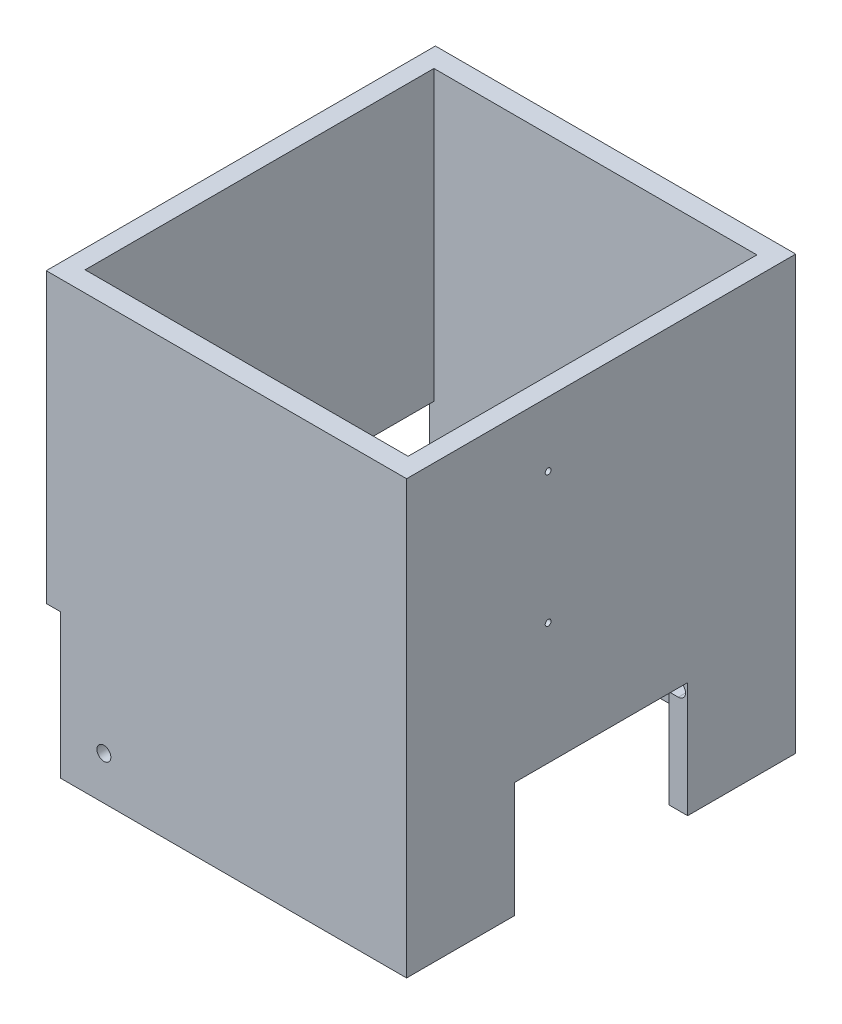
ISO-10303-21;
HEADER;
FILE_DESCRIPTION(('STEP AP214'),'2;1');
FILE_NAME('part.step','',(''),(''),'','','');
FILE_SCHEMA(('AUTOMOTIVE_DESIGN { 1 0 10303 214 1 1 1 1 }'));
ENDSEC;
DATA;
#1=APPLICATION_CONTEXT('core data for automotive mechanical design processes');
#2=APPLICATION_PROTOCOL_DEFINITION('international standard','automotive_design',2000,#1);
#3=PRODUCT_CONTEXT('',#1,'mechanical');
#4=PRODUCT('Part','Part','',(#3));
#5=PRODUCT_RELATED_PRODUCT_CATEGORY('part','',(#4));
#6=PRODUCT_DEFINITION_FORMATION('','',#4);
#7=PRODUCT_DEFINITION_CONTEXT('part definition',#1,'design');
#8=PRODUCT_DEFINITION('design','',#6,#7);
#9=PRODUCT_DEFINITION_SHAPE('','',#8);
#10=(LENGTH_UNIT() NAMED_UNIT(*) SI_UNIT(.MILLI.,.METRE.));
#11=(NAMED_UNIT(*) PLANE_ANGLE_UNIT() SI_UNIT($,.RADIAN.));
#12=(NAMED_UNIT(*) SI_UNIT($,.STERADIAN.) SOLID_ANGLE_UNIT());
#13=UNCERTAINTY_MEASURE_WITH_UNIT(LENGTH_MEASURE(1.E-05),#10,'distance_accuracy_value','');
#14=(GEOMETRIC_REPRESENTATION_CONTEXT(3) GLOBAL_UNCERTAINTY_ASSIGNED_CONTEXT((#13)) GLOBAL_UNIT_ASSIGNED_CONTEXT((#10,
#11,#12)) REPRESENTATION_CONTEXT('',''));
#15=CARTESIAN_POINT('',(0.,0.,0.));
#16=DIRECTION('',(0.,0.,1.));
#17=DIRECTION('',(1.,0.,0.));
#18=AXIS2_PLACEMENT_3D('',#15,#16,#17);
#19=CARTESIAN_POINT('',(0.,0.,0.));
#20=DIRECTION('',(0.,1.,0.));
#21=DIRECTION('',(0.,0.,1.));
#22=AXIS2_PLACEMENT_3D('',#19,#20,#21);
#23=PLANE('',#22);
#24=DIRECTION('',(-1.,0.,0.));
#25=VECTOR('',#24,1.);
#26=CARTESIAN_POINT('',(-56.0185185185184,0.,-60.5000000000001));
#27=LINE('',#26,#25);
#28=CARTESIAN_POINT('',(56.0185185185186,0.,-60.5000000000001));
#29=VERTEX_POINT('',#28);
#30=CARTESIAN_POINT('',(-57.4999999999999,0.,-60.5000000000001));
#31=VERTEX_POINT('',#30);
#32=EDGE_CURVE('E269',#29,#31,#27,.T.);
#33=ORIENTED_EDGE('',*,*,#32,.T.);
#34=DIRECTION('',(0.,0.,1.));
#35=VECTOR('',#34,1.);
#36=CARTESIAN_POINT('',(-57.4999999999999,0.,-67.5000000000001));
#37=LINE('',#36,#35);
#38=CARTESIAN_POINT('',(-57.4999999999999,0.,-67.5000000000001));
#39=VERTEX_POINT('',#38);
#40=EDGE_CURVE('E229',#39,#31,#37,.T.);
#41=ORIENTED_EDGE('',*,*,#40,.F.);
#42=DIRECTION('',(-1.,0.,0.));
#43=VECTOR('',#42,1.);
#44=CARTESIAN_POINT('',(-62.4999999999999,0.,-67.5000000000001));
#45=LINE('',#44,#43);
#46=CARTESIAN_POINT('',(62.5000000000001,0.,-67.5000000000001));
#47=VERTEX_POINT('',#46);
#48=EDGE_CURVE('E308',#47,#39,#45,.T.);
#49=ORIENTED_EDGE('',*,*,#48,.F.);
#50=DIRECTION('',(0.,0.,-1.));
#51=VECTOR('',#50,1.);
#52=CARTESIAN_POINT('',(62.5000000000001,0.,-67.5000000000001));
#53=LINE('',#52,#51);
#54=CARTESIAN_POINT('',(62.5000000000001,0.,-30.));
#55=VERTEX_POINT('',#54);
#56=EDGE_CURVE('E288',#55,#47,#53,.T.);
#57=ORIENTED_EDGE('',*,*,#56,.F.);
#58=DIRECTION('',(1.,0.,0.));
#59=VECTOR('',#58,1.);
#60=CARTESIAN_POINT('',(-62.5009999999999,0.,-30.));
#61=LINE('',#60,#59);
#62=CARTESIAN_POINT('',(56.0185185185186,0.,-30.));
#63=VERTEX_POINT('',#62);
#64=EDGE_CURVE('E411',#63,#55,#61,.T.);
#65=ORIENTED_EDGE('',*,*,#64,.F.);
#66=DIRECTION('',(0.,0.,-1.));
#67=VECTOR('',#66,1.);
#68=CARTESIAN_POINT('',(56.0185185185186,0.,60.4999999999999));
#69=LINE('',#68,#67);
#70=EDGE_CURVE('E243',#63,#29,#69,.T.);
#71=ORIENTED_EDGE('',*,*,#70,.T.);
#72=EDGE_LOOP('',(#33,#41,#49,#57,#65,#71));
#73=FACE_BOUND('',#72,.T.);
#74=ADVANCED_FACE('F41',(#73),#23,.F.);
#75=CARTESIAN_POINT('',(-57.4999999999999,0.,-67.5000000000001));
#76=DIRECTION('',(1.,0.,0.));
#77=DIRECTION('',(0.,0.,-1.));
#78=AXIS2_PLACEMENT_3D('',#75,#76,#77);
#79=PLANE('',#78);
#80=ORIENTED_EDGE('',*,*,#40,.T.);
#81=DIRECTION('',(0.,-1.,0.));
#82=VECTOR('',#81,1.);
#83=CARTESIAN_POINT('',(-57.4999999999999,0.,-60.5000000000001));
#84=LINE('',#83,#82);
#85=CARTESIAN_POINT('',(-57.4999999999999,50.,-60.5000000000001));
#86=VERTEX_POINT('',#85);
#87=EDGE_CURVE('E214',#86,#31,#84,.T.);
#88=ORIENTED_EDGE('',*,*,#87,.F.);
#89=DIRECTION('',(0.,0.,1.));
#90=VECTOR('',#89,1.);
#91=CARTESIAN_POINT('',(-57.4999999999999,50.,-67.5000000000001));
#92=LINE('',#91,#90);
#93=CARTESIAN_POINT('',(-57.4999999999999,50.,-67.5000000000001));
#94=VERTEX_POINT('',#93);
#95=EDGE_CURVE('E226',#94,#86,#92,.T.);
#96=ORIENTED_EDGE('',*,*,#95,.F.);
#97=DIRECTION('',(0.,1.,0.));
#98=VECTOR('',#97,1.);
#99=CARTESIAN_POINT('',(-57.4999999999999,0.,-67.5000000000001));
#100=LINE('',#99,#98);
#101=EDGE_CURVE('E442',#39,#94,#100,.T.);
#102=ORIENTED_EDGE('',*,*,#101,.F.);
#103=EDGE_LOOP('',(#80,#88,#96,#102));
#104=FACE_BOUND('',#103,.T.);
#105=ADVANCED_FACE('F225',(#104),#79,.F.);
#106=CARTESIAN_POINT('',(0.,150.,0.));
#107=DIRECTION('',(0.,1.,0.));
#108=DIRECTION('',(0.,0.,1.));
#109=AXIS2_PLACEMENT_3D('',#106,#107,#108);
#110=PLANE('',#109);
#111=DIRECTION('',(0.,0.,-1.));
#112=VECTOR('',#111,1.);
#113=CARTESIAN_POINT('',(62.5000000000001,150.,-67.5000000000001));
#114=LINE('',#113,#112);
#115=CARTESIAN_POINT('',(62.5000000000001,150.,67.4999999999999));
#116=VERTEX_POINT('',#115);
#117=CARTESIAN_POINT('',(62.5000000000001,150.,-67.5000000000001));
#118=VERTEX_POINT('',#117);
#119=EDGE_CURVE('E289',#116,#118,#114,.T.);
#120=ORIENTED_EDGE('',*,*,#119,.T.);
#121=DIRECTION('',(-1.,0.,0.));
#122=VECTOR('',#121,1.);
#123=CARTESIAN_POINT('',(-62.4999999999999,150.,-67.5000000000001));
#124=LINE('',#123,#122);
#125=CARTESIAN_POINT('',(-62.4999999999999,150.,-67.5000000000001));
#126=VERTEX_POINT('',#125);
#127=EDGE_CURVE('E293',#118,#126,#124,.T.);
#128=ORIENTED_EDGE('',*,*,#127,.T.);
#129=DIRECTION('',(0.,0.,1.));
#130=VECTOR('',#129,1.);
#131=CARTESIAN_POINT('',(-62.4999999999999,150.,-67.5000000000001));
#132=LINE('',#131,#130);
#133=CARTESIAN_POINT('',(-62.4999999999999,150.,67.4999999999999));
#134=VERTEX_POINT('',#133);
#135=EDGE_CURVE('E297',#126,#134,#132,.T.);
#136=ORIENTED_EDGE('',*,*,#135,.T.);
#137=DIRECTION('',(1.,0.,0.));
#138=VECTOR('',#137,1.);
#139=CARTESIAN_POINT('',(-62.4999999999999,150.,67.4999999999999));
#140=LINE('',#139,#138);
#141=EDGE_CURVE('E300',#134,#116,#140,.T.);
#142=ORIENTED_EDGE('',*,*,#141,.T.);
#143=EDGE_LOOP('',(#120,#128,#136,#142));
#144=FACE_BOUND('',#143,.T.);
#145=DIRECTION('',(-1.,0.,0.));
#146=VECTOR('',#145,1.);
#147=CARTESIAN_POINT('',(-56.0185185185184,150.,-60.5000000000001));
#148=LINE('',#147,#146);
#149=CARTESIAN_POINT('',(56.0185185185186,150.,-60.5000000000001));
#150=VERTEX_POINT('',#149);
#151=CARTESIAN_POINT('',(-56.0185185185184,150.,-60.5000000000001));
#152=VERTEX_POINT('',#151);
#153=EDGE_CURVE('E253',#150,#152,#148,.T.);
#154=ORIENTED_EDGE('',*,*,#153,.F.);
#155=DIRECTION('',(0.,0.,-1.));
#156=VECTOR('',#155,1.);
#157=CARTESIAN_POINT('',(56.0185185185186,150.,60.4999999999999));
#158=LINE('',#157,#156);
#159=CARTESIAN_POINT('',(56.0185185185186,150.,60.4999999999999));
#160=VERTEX_POINT('',#159);
#161=EDGE_CURVE('E250',#160,#150,#158,.T.);
#162=ORIENTED_EDGE('',*,*,#161,.F.);
#163=DIRECTION('',(1.,0.,0.));
#164=VECTOR('',#163,1.);
#165=CARTESIAN_POINT('',(-56.0185185185184,150.,60.4999999999999));
#166=LINE('',#165,#164);
#167=CARTESIAN_POINT('',(-56.0185185185184,150.,60.4999999999999));
#168=VERTEX_POINT('',#167);
#169=EDGE_CURVE('E261',#168,#160,#166,.T.);
#170=ORIENTED_EDGE('',*,*,#169,.F.);
#171=DIRECTION('',(0.,0.,1.));
#172=VECTOR('',#171,1.);
#173=CARTESIAN_POINT('',(-56.0185185185184,150.,60.4999999999999));
#174=LINE('',#173,#172);
#175=EDGE_CURVE('E257',#152,#168,#174,.T.);
#176=ORIENTED_EDGE('',*,*,#175,.F.);
#177=EDGE_LOOP('',(#154,#162,#170,#176));
#178=FACE_BOUND('',#177,.T.);
#179=ADVANCED_FACE('F470',(#144,#178),#110,.T.);
#180=CARTESIAN_POINT('',(-57.4999999999999,0.,60.4999999999999));
#181=VERTEX_POINT('',#180);
#182=CARTESIAN_POINT('',(-57.4999999999999,0.,67.4999999999999));
#183=VERTEX_POINT('',#182);
#184=EDGE_CURVE('E249',#181,#183,#37,.T.);
#185=ORIENTED_EDGE('',*,*,#184,.F.);
#186=DIRECTION('',(1.,0.,0.));
#187=VECTOR('',#186,1.);
#188=CARTESIAN_POINT('',(-56.0185185185184,0.,60.4999999999999));
#189=LINE('',#188,#187);
#190=CARTESIAN_POINT('',(56.0185185185186,0.,60.4999999999999));
#191=VERTEX_POINT('',#190);
#192=EDGE_CURVE('E254',#181,#191,#189,.T.);
#193=ORIENTED_EDGE('',*,*,#192,.T.);
#194=CARTESIAN_POINT('',(56.0185185185186,0.,30.));
#195=VERTEX_POINT('',#194);
#196=EDGE_CURVE('E265',#191,#195,#69,.T.);
#197=ORIENTED_EDGE('',*,*,#196,.T.);
#198=DIRECTION('',(1.,0.,0.));
#199=VECTOR('',#198,1.);
#200=CARTESIAN_POINT('',(-62.5009999999999,0.,30.));
#201=LINE('',#200,#199);
#202=CARTESIAN_POINT('',(62.5000000000001,0.,30.));
#203=VERTEX_POINT('',#202);
#204=EDGE_CURVE('E416',#195,#203,#201,.T.);
#205=ORIENTED_EDGE('',*,*,#204,.T.);
#206=CARTESIAN_POINT('',(62.5000000000001,0.,67.4999999999999));
#207=VERTEX_POINT('',#206);
#208=EDGE_CURVE('E304',#207,#203,#53,.T.);
#209=ORIENTED_EDGE('',*,*,#208,.F.);
#210=DIRECTION('',(1.,0.,0.));
#211=VECTOR('',#210,1.);
#212=CARTESIAN_POINT('',(-62.4999999999999,0.,67.4999999999999));
#213=LINE('',#212,#211);
#214=EDGE_CURVE('E294',#183,#207,#213,.T.);
#215=ORIENTED_EDGE('',*,*,#214,.F.);
#216=EDGE_LOOP('',(#185,#193,#197,#205,#209,#215));
#217=FACE_BOUND('',#216,.T.);
#218=ADVANCED_FACE('F460',(#217),#23,.F.);
#219=CARTESIAN_POINT('',(62.5000000000001,150.,-67.5000000000001));
#220=DIRECTION('',(-1.,0.,0.));
#221=DIRECTION('',(0.,0.,1.));
#222=AXIS2_PLACEMENT_3D('',#219,#220,#221);
#223=PLANE('',#222);
#224=CARTESIAN_POINT('',(62.5000000000001,127.656920999829,18.3915));
#225=DIRECTION('',(1.,0.,0.));
#226=DIRECTION('',(0.,0.,-1.));
#227=AXIS2_PLACEMENT_3D('',#224,#225,#226);
#228=CIRCLE('',#227,1.01599999999999);
#229=CARTESIAN_POINT('',(62.5000000000001,127.656920999829,17.3755));
#230=VERTEX_POINT('',#229);
#231=EDGE_CURVE('E505',#230,#230,#228,.T.);
#232=ORIENTED_EDGE('',*,*,#231,.F.);
#233=EDGE_LOOP('',(#232));
#234=FACE_BOUND('',#233,.T.);
#235=CARTESIAN_POINT('',(62.5000000000001,82.1569209998292,18.3915));
#236=DIRECTION('',(1.,0.,0.));
#237=DIRECTION('',(0.,0.,-1.));
#238=AXIS2_PLACEMENT_3D('',#235,#236,#237);
#239=CIRCLE('',#238,1.01599999999999);
#240=CARTESIAN_POINT('',(62.5000000000001,82.1569209998292,17.3755));
#241=VERTEX_POINT('',#240);
#242=EDGE_CURVE('E513',#241,#241,#239,.T.);
#243=ORIENTED_EDGE('',*,*,#242,.F.);
#244=EDGE_LOOP('',(#243));
#245=FACE_BOUND('',#244,.T.);
#246=ORIENTED_EDGE('',*,*,#208,.T.);
#247=DIRECTION('',(0.,-1.,0.));
#248=VECTOR('',#247,1.);
#249=CARTESIAN_POINT('',(62.5000000000001,0.,30.));
#250=LINE('',#249,#248);
#251=CARTESIAN_POINT('',(62.5000000000001,40.,30.));
#252=VERTEX_POINT('',#251);
#253=EDGE_CURVE('E408',#252,#203,#250,.T.);
#254=ORIENTED_EDGE('',*,*,#253,.F.);
#255=DIRECTION('',(0.,0.,1.));
#256=VECTOR('',#255,1.);
#257=CARTESIAN_POINT('',(62.5000000000001,40.,30.));
#258=LINE('',#257,#256);
#259=CARTESIAN_POINT('',(62.5000000000001,40.,-30.));
#260=VERTEX_POINT('',#259);
#261=EDGE_CURVE('E399',#260,#252,#258,.T.);
#262=ORIENTED_EDGE('',*,*,#261,.F.);
#263=DIRECTION('',(0.,1.,0.));
#264=VECTOR('',#263,1.);
#265=CARTESIAN_POINT('',(62.5000000000001,0.,-30.));
#266=LINE('',#265,#264);
#267=EDGE_CURVE('E404',#55,#260,#266,.T.);
#268=ORIENTED_EDGE('',*,*,#267,.F.);
#269=ORIENTED_EDGE('',*,*,#56,.T.);
#270=DIRECTION('',(0.,-1.,0.));
#271=VECTOR('',#270,1.);
#272=CARTESIAN_POINT('',(62.5000000000001,150.,-67.5000000000001));
#273=LINE('',#272,#271);
#274=EDGE_CURVE('E325',#118,#47,#273,.T.);
#275=ORIENTED_EDGE('',*,*,#274,.F.);
#276=ORIENTED_EDGE('',*,*,#119,.F.);
#277=DIRECTION('',(0.,-1.,0.));
#278=VECTOR('',#277,1.);
#279=CARTESIAN_POINT('',(62.5000000000001,150.,67.4999999999999));
#280=LINE('',#279,#278);
#281=EDGE_CURVE('E303',#116,#207,#280,.T.);
#282=ORIENTED_EDGE('',*,*,#281,.T.);
#283=EDGE_LOOP('',(#246,#254,#262,#268,#269,#275,#276,#282));
#284=FACE_BOUND('',#283,.T.);
#285=ADVANCED_FACE('F43',(#234,#245,#284),#223,.F.);
#286=CARTESIAN_POINT('',(-62.4999999999999,150.,-67.5000000000001));
#287=DIRECTION('',(0.,0.,1.));
#288=DIRECTION('',(1.,0.,0.));
#289=AXIS2_PLACEMENT_3D('',#286,#287,#288);
#290=PLANE('',#289);
#291=CARTESIAN_POINT('',(-42.4999999999999,15.,-67.4999999999999));
#292=DIRECTION('',(0.,0.,-1.));
#293=DIRECTION('',(-1.,0.,0.));
#294=AXIS2_PLACEMENT_3D('',#291,#292,#293);
#295=CIRCLE('',#294,2.413);
#296=CARTESIAN_POINT('',(-44.9129999999999,15.,-67.4999999999999));
#297=VERTEX_POINT('',#296);
#298=EDGE_CURVE('E382',#297,#297,#295,.T.);
#299=ORIENTED_EDGE('',*,*,#298,.F.);
#300=EDGE_LOOP('',(#299));
#301=FACE_BOUND('',#300,.T.);
#302=ORIENTED_EDGE('',*,*,#101,.T.);
#303=DIRECTION('',(-1.,0.,0.));
#304=VECTOR('',#303,1.);
#305=CARTESIAN_POINT('',(-62.4999999999999,50.,-67.5000000000001));
#306=LINE('',#305,#304);
#307=CARTESIAN_POINT('',(-62.4999999999999,50.,-67.5000000000001));
#308=VERTEX_POINT('',#307);
#309=EDGE_CURVE('E234',#94,#308,#306,.T.);
#310=ORIENTED_EDGE('',*,*,#309,.T.);
#311=DIRECTION('',(0.,-1.,0.));
#312=VECTOR('',#311,1.);
#313=CARTESIAN_POINT('',(-62.4999999999999,150.,-67.5000000000001));
#314=LINE('',#313,#312);
#315=EDGE_CURVE('E321',#126,#308,#314,.T.);
#316=ORIENTED_EDGE('',*,*,#315,.F.);
#317=ORIENTED_EDGE('',*,*,#127,.F.);
#318=ORIENTED_EDGE('',*,*,#274,.T.);
#319=ORIENTED_EDGE('',*,*,#48,.T.);
#320=EDGE_LOOP('',(#302,#310,#316,#317,#318,#319));
#321=FACE_BOUND('',#320,.T.);
#322=ADVANCED_FACE('F615',(#301,#321),#290,.F.);
#323=CARTESIAN_POINT('',(-62.4999999999999,150.,-67.5000000000001));
#324=DIRECTION('',(1.,0.,0.));
#325=DIRECTION('',(0.,0.,-1.));
#326=AXIS2_PLACEMENT_3D('',#323,#324,#325);
#327=PLANE('',#326);
#328=ORIENTED_EDGE('',*,*,#315,.T.);
#329=DIRECTION('',(0.,0.,1.));
#330=VECTOR('',#329,1.);
#331=CARTESIAN_POINT('',(-62.4999999999999,50.,-67.5000000000001));
#332=LINE('',#331,#330);
#333=CARTESIAN_POINT('',(-62.4999999999999,50.,67.4999999999999));
#334=VERTEX_POINT('',#333);
#335=EDGE_CURVE('E237',#308,#334,#332,.T.);
#336=ORIENTED_EDGE('',*,*,#335,.T.);
#337=DIRECTION('',(0.,-1.,0.));
#338=VECTOR('',#337,1.);
#339=CARTESIAN_POINT('',(-62.4999999999999,150.,67.4999999999999));
#340=LINE('',#339,#338);
#341=EDGE_CURVE('E317',#134,#334,#340,.T.);
#342=ORIENTED_EDGE('',*,*,#341,.F.);
#343=ORIENTED_EDGE('',*,*,#135,.F.);
#344=EDGE_LOOP('',(#328,#336,#342,#343));
#345=FACE_BOUND('',#344,.T.);
#346=ADVANCED_FACE('F474',(#345),#327,.F.);
#347=CARTESIAN_POINT('',(-62.4999999999999,150.,67.4999999999999));
#348=DIRECTION('',(0.,0.,-1.));
#349=DIRECTION('',(-1.,0.,0.));
#350=AXIS2_PLACEMENT_3D('',#347,#348,#349);
#351=PLANE('',#350);
#352=CARTESIAN_POINT('',(-42.4999999999999,15.,67.4999999999999));
#353=DIRECTION('',(0.,0.,1.));
#354=DIRECTION('',(1.,0.,0.));
#355=AXIS2_PLACEMENT_3D('',#352,#353,#354);
#356=CIRCLE('',#355,2.413);
#357=CARTESIAN_POINT('',(-40.0869999999999,15.,67.4999999999999));
#358=VERTEX_POINT('',#357);
#359=EDGE_CURVE('E390',#358,#358,#356,.T.);
#360=ORIENTED_EDGE('',*,*,#359,.F.);
#361=EDGE_LOOP('',(#360));
#362=FACE_BOUND('',#361,.T.);
#363=ORIENTED_EDGE('',*,*,#341,.T.);
#364=DIRECTION('',(-1.,0.,0.));
#365=VECTOR('',#364,1.);
#366=CARTESIAN_POINT('',(-62.4999999999999,50.,67.4999999999999));
#367=LINE('',#366,#365);
#368=CARTESIAN_POINT('',(-57.4999999999999,50.,67.4999999999999));
#369=VERTEX_POINT('',#368);
#370=EDGE_CURVE('E439',#369,#334,#367,.T.);
#371=ORIENTED_EDGE('',*,*,#370,.F.);
#372=DIRECTION('',(0.,1.,0.));
#373=VECTOR('',#372,1.);
#374=CARTESIAN_POINT('',(-57.4999999999999,0.,67.4999999999999));
#375=LINE('',#374,#373);
#376=EDGE_CURVE('E403',#183,#369,#375,.T.);
#377=ORIENTED_EDGE('',*,*,#376,.F.);
#378=ORIENTED_EDGE('',*,*,#214,.T.);
#379=ORIENTED_EDGE('',*,*,#281,.F.);
#380=ORIENTED_EDGE('',*,*,#141,.F.);
#381=EDGE_LOOP('',(#363,#371,#377,#378,#379,#380));
#382=FACE_BOUND('',#381,.T.);
#383=ADVANCED_FACE('F457',(#362,#382),#351,.F.);
#384=CARTESIAN_POINT('',(56.0185185185186,150.,60.4999999999999));
#385=DIRECTION('',(-1.,0.,0.));
#386=DIRECTION('',(0.,0.,1.));
#387=AXIS2_PLACEMENT_3D('',#384,#385,#386);
#388=PLANE('',#387);
#389=CARTESIAN_POINT('',(56.0185185185186,127.656920999829,18.3915));
#390=DIRECTION('',(-1.,0.,0.));
#391=DIRECTION('',(0.,0.,1.));
#392=AXIS2_PLACEMENT_3D('',#389,#390,#391);
#393=CIRCLE('',#392,1.01599999999999);
#394=CARTESIAN_POINT('',(56.0185185185186,127.656920999829,19.4075));
#395=VERTEX_POINT('',#394);
#396=EDGE_CURVE('E509',#395,#395,#393,.T.);
#397=ORIENTED_EDGE('',*,*,#396,.F.);
#398=EDGE_LOOP('',(#397));
#399=FACE_BOUND('',#398,.T.);
#400=CARTESIAN_POINT('',(56.0185185185186,82.1569209998292,18.3915));
#401=DIRECTION('',(-1.,0.,0.));
#402=DIRECTION('',(0.,0.,1.));
#403=AXIS2_PLACEMENT_3D('',#400,#401,#402);
#404=CIRCLE('',#403,1.016);
#405=CARTESIAN_POINT('',(56.0185185185186,82.1569209998292,19.4075));
#406=VERTEX_POINT('',#405);
#407=EDGE_CURVE('E517',#406,#406,#404,.T.);
#408=ORIENTED_EDGE('',*,*,#407,.F.);
#409=EDGE_LOOP('',(#408));
#410=FACE_BOUND('',#409,.T.);
#411=DIRECTION('',(0.,0.,1.));
#412=VECTOR('',#411,1.);
#413=CARTESIAN_POINT('',(56.0185185185186,39.,-37.5));
#414=LINE('',#413,#412);
#415=CARTESIAN_POINT('',(56.0185185185186,39.,-37.5));
#416=VERTEX_POINT('',#415);
#417=CARTESIAN_POINT('',(56.0185185185186,39.,-30.));
#418=VERTEX_POINT('',#417);
#419=EDGE_CURVE('E371',#416,#418,#414,.T.);
#420=ORIENTED_EDGE('',*,*,#419,.T.);
#421=DIRECTION('',(0.,1.,0.));
#422=VECTOR('',#421,1.);
#423=CARTESIAN_POINT('',(56.0185185185186,0.,-30.));
#424=LINE('',#423,#422);
#425=CARTESIAN_POINT('',(56.0185185185186,40.,-30.));
#426=VERTEX_POINT('',#425);
#427=EDGE_CURVE('E426',#418,#426,#424,.T.);
#428=ORIENTED_EDGE('',*,*,#427,.T.);
#429=DIRECTION('',(0.,0.,1.));
#430=VECTOR('',#429,1.);
#431=CARTESIAN_POINT('',(56.0185185185186,40.,30.));
#432=LINE('',#431,#430);
#433=CARTESIAN_POINT('',(56.0185185185186,40.,30.));
#434=VERTEX_POINT('',#433);
#435=EDGE_CURVE('E417',#426,#434,#432,.T.);
#436=ORIENTED_EDGE('',*,*,#435,.T.);
#437=DIRECTION('',(0.,-1.,0.));
#438=VECTOR('',#437,1.);
#439=CARTESIAN_POINT('',(56.0185185185186,0.,30.));
#440=LINE('',#439,#438);
#441=CARTESIAN_POINT('',(56.0185185185186,39.,30.));
#442=VERTEX_POINT('',#441);
#443=EDGE_CURVE('E412',#434,#442,#440,.T.);
#444=ORIENTED_EDGE('',*,*,#443,.T.);
#445=CARTESIAN_POINT('',(56.0185185185186,39.,37.5));
#446=VERTEX_POINT('',#445);
#447=EDGE_CURVE('E373',#442,#446,#414,.T.);
#448=ORIENTED_EDGE('',*,*,#447,.T.);
#449=DIRECTION('',(0.,-1.,0.));
#450=VECTOR('',#449,1.);
#451=CARTESIAN_POINT('',(56.0185185185186,39.,37.5));
#452=LINE('',#451,#450);
#453=CARTESIAN_POINT('',(56.0185185185186,34.,37.5));
#454=VERTEX_POINT('',#453);
#455=EDGE_CURVE('E538',#446,#454,#452,.T.);
#456=ORIENTED_EDGE('',*,*,#455,.T.);
#457=DIRECTION('',(0.,0.,1.));
#458=VECTOR('',#457,1.);
#459=CARTESIAN_POINT('',(56.0185185185186,34.,-37.5));
#460=LINE('',#459,#458);
#461=CARTESIAN_POINT('',(56.0185185185186,34.,30.));
#462=VERTEX_POINT('',#461);
#463=EDGE_CURVE('E370',#462,#454,#460,.T.);
#464=ORIENTED_EDGE('',*,*,#463,.F.);
#465=EDGE_CURVE('E398',#462,#195,#440,.T.);
#466=ORIENTED_EDGE('',*,*,#465,.T.);
#467=ORIENTED_EDGE('',*,*,#196,.F.);
#468=DIRECTION('',(0.,-1.,0.));
#469=VECTOR('',#468,1.);
#470=CARTESIAN_POINT('',(56.0185185185186,150.,60.4999999999999));
#471=LINE('',#470,#469);
#472=EDGE_CURVE('E264',#160,#191,#471,.T.);
#473=ORIENTED_EDGE('',*,*,#472,.F.);
#474=ORIENTED_EDGE('',*,*,#161,.T.);
#475=DIRECTION('',(0.,-1.,0.));
#476=VECTOR('',#475,1.);
#477=CARTESIAN_POINT('',(56.0185185185186,150.,-60.5000000000001));
#478=LINE('',#477,#476);
#479=EDGE_CURVE('E284',#150,#29,#478,.T.);
#480=ORIENTED_EDGE('',*,*,#479,.T.);
#481=ORIENTED_EDGE('',*,*,#70,.F.);
#482=CARTESIAN_POINT('',(56.0185185185186,34.,-30.));
#483=VERTEX_POINT('',#482);
#484=EDGE_CURVE('E422',#63,#483,#424,.T.);
#485=ORIENTED_EDGE('',*,*,#484,.T.);
#486=CARTESIAN_POINT('',(56.0185185185186,34.,-37.5));
#487=VERTEX_POINT('',#486);
#488=EDGE_CURVE('E367',#487,#483,#460,.T.);
#489=ORIENTED_EDGE('',*,*,#488,.F.);
#490=DIRECTION('',(0.,-1.,0.));
#491=VECTOR('',#490,1.);
#492=CARTESIAN_POINT('',(56.0185185185186,39.,-37.5));
#493=LINE('',#492,#491);
#494=EDGE_CURVE('E524',#416,#487,#493,.T.);
#495=ORIENTED_EDGE('',*,*,#494,.F.);
#496=EDGE_LOOP('',(#420,#428,#436,#444,#448,#456,#464,#466,#467,#473,#474,#480,#481,#485,#489,#495));
#497=FACE_BOUND('',#496,.T.);
#498=ADVANCED_FACE('F557',(#399,#410,#497),#388,.T.);
#499=CARTESIAN_POINT('',(-56.0185185185184,150.,-60.5000000000001));
#500=DIRECTION('',(0.,0.,1.));
#501=DIRECTION('',(1.,0.,0.));
#502=AXIS2_PLACEMENT_3D('',#499,#500,#501);
#503=PLANE('',#502);
#504=CARTESIAN_POINT('',(-42.4999999999999,15.,-60.5000000000001));
#505=DIRECTION('',(0.,0.,1.));
#506=DIRECTION('',(1.,0.,0.));
#507=AXIS2_PLACEMENT_3D('',#504,#505,#506);
#508=CIRCLE('',#507,2.41299999999999);
#509=CARTESIAN_POINT('',(-40.0869999999999,15.,-60.5000000000001));
#510=VERTEX_POINT('',#509);
#511=EDGE_CURVE('E386',#510,#510,#508,.T.);
#512=ORIENTED_EDGE('',*,*,#511,.F.);
#513=EDGE_LOOP('',(#512));
#514=FACE_BOUND('',#513,.T.);
#515=ORIENTED_EDGE('',*,*,#32,.F.);
#516=ORIENTED_EDGE('',*,*,#479,.F.);
#517=ORIENTED_EDGE('',*,*,#153,.T.);
#518=DIRECTION('',(0.,-1.,0.));
#519=VECTOR('',#518,1.);
#520=CARTESIAN_POINT('',(-56.0185185185184,150.,-60.5000000000001));
#521=LINE('',#520,#519);
#522=CARTESIAN_POINT('',(-56.0185185185184,50.,-60.5000000000001));
#523=VERTEX_POINT('',#522);
#524=EDGE_CURVE('E217',#152,#523,#521,.T.);
#525=ORIENTED_EDGE('',*,*,#524,.T.);
#526=DIRECTION('',(-1.,0.,0.));
#527=VECTOR('',#526,1.);
#528=CARTESIAN_POINT('',(62.5010000000001,50.,-60.5000000000001));
#529=LINE('',#528,#527);
#530=EDGE_CURVE('E210',#523,#86,#529,.T.);
#531=ORIENTED_EDGE('',*,*,#530,.T.);
#532=ORIENTED_EDGE('',*,*,#87,.T.);
#533=EDGE_LOOP('',(#515,#516,#517,#525,#531,#532));
#534=FACE_BOUND('',#533,.T.);
#535=ADVANCED_FACE('F213',(#514,#534),#503,.T.);
#536=CARTESIAN_POINT('',(-56.0185185185184,150.,60.4999999999999));
#537=DIRECTION('',(1.,0.,0.));
#538=DIRECTION('',(0.,0.,-1.));
#539=AXIS2_PLACEMENT_3D('',#536,#537,#538);
#540=PLANE('',#539);
#541=DIRECTION('',(0.,0.,-1.));
#542=VECTOR('',#541,1.);
#543=CARTESIAN_POINT('',(-56.0185185185184,50.,-60.5000000000001));
#544=LINE('',#543,#542);
#545=CARTESIAN_POINT('',(-56.0185185185184,50.,60.4999999999999));
#546=VERTEX_POINT('',#545);
#547=EDGE_CURVE('E222',#546,#523,#544,.T.);
#548=ORIENTED_EDGE('',*,*,#547,.T.);
#549=ORIENTED_EDGE('',*,*,#524,.F.);
#550=ORIENTED_EDGE('',*,*,#175,.T.);
#551=DIRECTION('',(0.,-1.,0.));
#552=VECTOR('',#551,1.);
#553=CARTESIAN_POINT('',(-56.0185185185184,150.,60.4999999999999));
#554=LINE('',#553,#552);
#555=EDGE_CURVE('E278',#168,#546,#554,.T.);
#556=ORIENTED_EDGE('',*,*,#555,.T.);
#557=EDGE_LOOP('',(#548,#549,#550,#556));
#558=FACE_BOUND('',#557,.T.);
#559=CARTESIAN_POINT('',(-56.0185185185184,67.1120985681162,-10.2126000000001));
#560=DIRECTION('',(1.,0.,0.));
#561=DIRECTION('',(0.,0.,-1.));
#562=AXIS2_PLACEMENT_3D('',#559,#560,#561);
#563=CIRCLE('',#562,1.95579999999999);
#564=CARTESIAN_POINT('',(-56.0185185185184,67.1120985681162,-12.1684000000001));
#565=VERTEX_POINT('',#564);
#566=EDGE_CURVE('E481',#565,#565,#563,.T.);
#567=ORIENTED_EDGE('',*,*,#566,.F.);
#568=EDGE_LOOP('',(#567));
#569=FACE_BOUND('',#568,.T.);
#570=CARTESIAN_POINT('',(-56.0185185185184,67.1120985681162,-18.7126000000001));
#571=DIRECTION('',(1.,0.,0.));
#572=DIRECTION('',(0.,0.,-1.));
#573=AXIS2_PLACEMENT_3D('',#570,#571,#572);
#574=CIRCLE('',#573,1.95579999999999);
#575=CARTESIAN_POINT('',(-56.0185185185184,67.1120985681162,-20.6684000000001));
#576=VERTEX_POINT('',#575);
#577=EDGE_CURVE('E493',#576,#576,#574,.T.);
#578=ORIENTED_EDGE('',*,*,#577,.F.);
#579=EDGE_LOOP('',(#578));
#580=FACE_BOUND('',#579,.T.);
#581=ADVANCED_FACE('F589',(#558,#569,#580),#540,.T.);
#582=CARTESIAN_POINT('',(-56.0185185185184,150.,60.4999999999999));
#583=DIRECTION('',(0.,0.,-1.));
#584=DIRECTION('',(-1.,0.,0.));
#585=AXIS2_PLACEMENT_3D('',#582,#583,#584);
#586=PLANE('',#585);
#587=CARTESIAN_POINT('',(-42.4999999999999,15.,60.4999999999999));
#588=DIRECTION('',(0.,0.,-1.));
#589=DIRECTION('',(-1.,0.,0.));
#590=AXIS2_PLACEMENT_3D('',#587,#588,#589);
#591=CIRCLE('',#590,2.41299999999999);
#592=CARTESIAN_POINT('',(-44.9129999999999,15.,60.4999999999999));
#593=VERTEX_POINT('',#592);
#594=EDGE_CURVE('E394',#593,#593,#591,.T.);
#595=ORIENTED_EDGE('',*,*,#594,.F.);
#596=EDGE_LOOP('',(#595));
#597=FACE_BOUND('',#596,.T.);
#598=ORIENTED_EDGE('',*,*,#192,.F.);
#599=DIRECTION('',(0.,1.,0.));
#600=VECTOR('',#599,1.);
#601=CARTESIAN_POINT('',(-57.4999999999999,0.,60.4999999999999));
#602=LINE('',#601,#600);
#603=CARTESIAN_POINT('',(-57.4999999999999,50.,60.4999999999999));
#604=VERTEX_POINT('',#603);
#605=EDGE_CURVE('E57',#181,#604,#602,.T.);
#606=ORIENTED_EDGE('',*,*,#605,.T.);
#607=DIRECTION('',(-1.,0.,0.));
#608=VECTOR('',#607,1.);
#609=CARTESIAN_POINT('',(62.5010000000001,50.,60.4999999999999));
#610=LINE('',#609,#608);
#611=EDGE_CURVE('E475',#546,#604,#610,.T.);
#612=ORIENTED_EDGE('',*,*,#611,.F.);
#613=ORIENTED_EDGE('',*,*,#555,.F.);
#614=ORIENTED_EDGE('',*,*,#169,.T.);
#615=ORIENTED_EDGE('',*,*,#472,.T.);
#616=EDGE_LOOP('',(#598,#606,#612,#613,#614,#615));
#617=FACE_BOUND('',#616,.T.);
#618=ADVANCED_FACE('F591',(#597,#617),#586,.T.);
#619=CARTESIAN_POINT('',(-62.4999999999999,50.,-67.5000000000001));
#620=DIRECTION('',(0.,1.,0.));
#621=DIRECTION('',(0.,0.,1.));
#622=AXIS2_PLACEMENT_3D('',#619,#620,#621);
#623=PLANE('',#622);
#624=ORIENTED_EDGE('',*,*,#335,.F.);
#625=ORIENTED_EDGE('',*,*,#309,.F.);
#626=ORIENTED_EDGE('',*,*,#95,.T.);
#627=ORIENTED_EDGE('',*,*,#530,.F.);
#628=ORIENTED_EDGE('',*,*,#547,.F.);
#629=ORIENTED_EDGE('',*,*,#611,.T.);
#630=EDGE_CURVE('E238',#604,#369,#92,.T.);
#631=ORIENTED_EDGE('',*,*,#630,.T.);
#632=ORIENTED_EDGE('',*,*,#370,.T.);
#633=EDGE_LOOP('',(#624,#625,#626,#627,#628,#629,#631,#632));
#634=FACE_BOUND('',#633,.T.);
#635=ADVANCED_FACE('F232',(#634),#623,.F.);
#636=ORIENTED_EDGE('',*,*,#630,.F.);
#637=ORIENTED_EDGE('',*,*,#605,.F.);
#638=ORIENTED_EDGE('',*,*,#184,.T.);
#639=ORIENTED_EDGE('',*,*,#376,.T.);
#640=EDGE_LOOP('',(#636,#637,#638,#639));
#641=FACE_BOUND('',#640,.T.);
#642=ADVANCED_FACE('F452',(#641),#79,.F.);
#643=CARTESIAN_POINT('',(-62.5009999999999,0.,30.));
#644=DIRECTION('',(0.,0.,1.));
#645=DIRECTION('',(1.,0.,0.));
#646=AXIS2_PLACEMENT_3D('',#643,#644,#645);
#647=PLANE('',#646);
#648=CARTESIAN_POINT('',(59.2592592592594,36.5,30.));
#649=DIRECTION('',(0.,0.,1.));
#650=DIRECTION('',(1.,0.,0.));
#651=AXIS2_PLACEMENT_3D('',#648,#649,#650);
#652=CIRCLE('',#651,2.5);
#653=CARTESIAN_POINT('',(59.2592592592594,34.,30.));
#654=VERTEX_POINT('',#653);
#655=CARTESIAN_POINT('',(59.2592592592594,39.,30.));
#656=VERTEX_POINT('',#655);
#657=EDGE_CURVE('E359',#654,#656,#652,.T.);
#658=ORIENTED_EDGE('',*,*,#657,.T.);
#659=DIRECTION('',(-1.,0.,0.));
#660=VECTOR('',#659,1.);
#661=CARTESIAN_POINT('',(-62.5009999999999,39.,30.));
#662=LINE('',#661,#660);
#663=EDGE_CURVE('E378',#656,#442,#662,.T.);
#664=ORIENTED_EDGE('',*,*,#663,.T.);
#665=ORIENTED_EDGE('',*,*,#443,.F.);
#666=DIRECTION('',(1.,0.,0.));
#667=VECTOR('',#666,1.);
#668=CARTESIAN_POINT('',(-62.5009999999999,40.,30.));
#669=LINE('',#668,#667);
#670=EDGE_CURVE('E421',#434,#252,#669,.T.);
#671=ORIENTED_EDGE('',*,*,#670,.T.);
#672=ORIENTED_EDGE('',*,*,#253,.T.);
#673=ORIENTED_EDGE('',*,*,#204,.F.);
#674=ORIENTED_EDGE('',*,*,#465,.F.);
#675=DIRECTION('',(1.,0.,0.));
#676=VECTOR('',#675,1.);
#677=CARTESIAN_POINT('',(-62.5009999999999,34.,30.));
#678=LINE('',#677,#676);
#679=EDGE_CURVE('E353',#462,#654,#678,.T.);
#680=ORIENTED_EDGE('',*,*,#679,.T.);
#681=EDGE_LOOP('',(#658,#664,#665,#671,#672,#673,#674,#680));
#682=FACE_BOUND('',#681,.T.);
#683=ADVANCED_FACE('F565',(#682),#647,.F.);
#684=CARTESIAN_POINT('',(-62.5009999999999,40.,30.));
#685=DIRECTION('',(0.,1.,0.));
#686=DIRECTION('',(0.,0.,1.));
#687=AXIS2_PLACEMENT_3D('',#684,#685,#686);
#688=PLANE('',#687);
#689=DIRECTION('',(1.,0.,0.));
#690=VECTOR('',#689,1.);
#691=CARTESIAN_POINT('',(-62.5009999999999,40.,-30.));
#692=LINE('',#691,#690);
#693=EDGE_CURVE('E425',#426,#260,#692,.T.);
#694=ORIENTED_EDGE('',*,*,#693,.T.);
#695=ORIENTED_EDGE('',*,*,#261,.T.);
#696=ORIENTED_EDGE('',*,*,#670,.F.);
#697=ORIENTED_EDGE('',*,*,#435,.F.);
#698=EDGE_LOOP('',(#694,#695,#696,#697));
#699=FACE_BOUND('',#698,.T.);
#700=ADVANCED_FACE('F574',(#699),#688,.F.);
#701=CARTESIAN_POINT('',(-62.5009999999999,0.,-30.));
#702=DIRECTION('',(0.,0.,-1.));
#703=DIRECTION('',(-1.,0.,0.));
#704=AXIS2_PLACEMENT_3D('',#701,#702,#703);
#705=PLANE('',#704);
#706=ORIENTED_EDGE('',*,*,#427,.F.);
#707=DIRECTION('',(1.,0.,0.));
#708=VECTOR('',#707,1.);
#709=CARTESIAN_POINT('',(-62.5009999999999,39.,-30.));
#710=LINE('',#709,#708);
#711=CARTESIAN_POINT('',(59.2592592592594,39.,-30.));
#712=VERTEX_POINT('',#711);
#713=EDGE_CURVE('E11',#418,#712,#710,.T.);
#714=ORIENTED_EDGE('',*,*,#713,.T.);
#715=CARTESIAN_POINT('',(59.2592592592594,36.5,-30.));
#716=DIRECTION('',(0.,0.,-1.));
#717=DIRECTION('',(-1.,0.,0.));
#718=AXIS2_PLACEMENT_3D('',#715,#716,#717);
#719=CIRCLE('',#718,2.5);
#720=CARTESIAN_POINT('',(59.2592592592594,34.,-30.));
#721=VERTEX_POINT('',#720);
#722=EDGE_CURVE('E50',#712,#721,#719,.T.);
#723=ORIENTED_EDGE('',*,*,#722,.T.);
#724=DIRECTION('',(-1.,0.,0.));
#725=VECTOR('',#724,1.);
#726=CARTESIAN_POINT('',(-62.5009999999999,34.,-30.));
#727=LINE('',#726,#725);
#728=EDGE_CURVE('E329',#721,#483,#727,.T.);
#729=ORIENTED_EDGE('',*,*,#728,.T.);
#730=ORIENTED_EDGE('',*,*,#484,.F.);
#731=ORIENTED_EDGE('',*,*,#64,.T.);
#732=ORIENTED_EDGE('',*,*,#267,.T.);
#733=ORIENTED_EDGE('',*,*,#693,.F.);
#734=EDGE_LOOP('',(#706,#714,#723,#729,#730,#731,#732,#733));
#735=FACE_BOUND('',#734,.T.);
#736=ADVANCED_FACE('F336',(#735),#705,.F.);
#737=CARTESIAN_POINT('',(-42.4999999999999,15.,67.4999999999999));
#738=DIRECTION('',(0.,0.,1.));
#739=DIRECTION('',(1.,0.,0.));
#740=AXIS2_PLACEMENT_3D('',#737,#738,#739);
#741=CYLINDRICAL_SURFACE('',#740,2.41299999999999);
#742=ORIENTED_EDGE('',*,*,#594,.T.);
#743=EDGE_LOOP('',(#742));
#744=FACE_BOUND('',#743,.T.);
#745=ORIENTED_EDGE('',*,*,#359,.T.);
#746=EDGE_LOOP('',(#745));
#747=FACE_BOUND('',#746,.T.);
#748=ADVANCED_FACE('F633',(#744,#747),#741,.F.);
#749=CARTESIAN_POINT('',(-42.4999999999999,15.,-67.4999999999999));
#750=DIRECTION('',(0.,0.,-1.));
#751=DIRECTION('',(-1.,0.,0.));
#752=AXIS2_PLACEMENT_3D('',#749,#750,#751);
#753=CYLINDRICAL_SURFACE('',#752,2.41299999999999);
#754=ORIENTED_EDGE('',*,*,#511,.T.);
#755=EDGE_LOOP('',(#754));
#756=FACE_BOUND('',#755,.T.);
#757=ORIENTED_EDGE('',*,*,#298,.T.);
#758=EDGE_LOOP('',(#757));
#759=FACE_BOUND('',#758,.T.);
#760=ADVANCED_FACE('F629',(#756,#759),#753,.F.);
#761=CARTESIAN_POINT('',(56.0185185185186,34.,-37.5));
#762=DIRECTION('',(0.,-1.,0.));
#763=DIRECTION('',(0.,0.,-1.));
#764=AXIS2_PLACEMENT_3D('',#761,#762,#763);
#765=PLANE('',#764);
#766=DIRECTION('',(0.,0.,1.));
#767=VECTOR('',#766,1.);
#768=CARTESIAN_POINT('',(59.2592592592594,34.,-37.5));
#769=LINE('',#768,#767);
#770=CARTESIAN_POINT('',(59.2592592592594,34.,-37.5));
#771=VERTEX_POINT('',#770);
#772=EDGE_CURVE('E345',#771,#721,#769,.T.);
#773=ORIENTED_EDGE('',*,*,#772,.F.);
#774=DIRECTION('',(1.,0.,0.));
#775=VECTOR('',#774,1.);
#776=CARTESIAN_POINT('',(56.0185185185186,34.,-37.5));
#777=LINE('',#776,#775);
#778=EDGE_CURVE('E528',#487,#771,#777,.T.);
#779=ORIENTED_EDGE('',*,*,#778,.F.);
#780=ORIENTED_EDGE('',*,*,#488,.T.);
#781=ORIENTED_EDGE('',*,*,#728,.F.);
#782=EDGE_LOOP('',(#773,#779,#780,#781));
#783=FACE_BOUND('',#782,.T.);
#784=ADVANCED_FACE('F632',(#783),#765,.F.);
#785=CARTESIAN_POINT('',(59.2592592592594,36.5,-37.5));
#786=DIRECTION('',(0.,0.,1.));
#787=DIRECTION('',(1.,0.,0.));
#788=AXIS2_PLACEMENT_3D('',#785,#786,#787);
#789=CYLINDRICAL_SURFACE('',#788,2.5);
#790=DIRECTION('',(0.,0.,1.));
#791=VECTOR('',#790,1.);
#792=CARTESIAN_POINT('',(59.2592592592594,39.,-37.5));
#793=LINE('',#792,#791);
#794=CARTESIAN_POINT('',(59.2592592592594,39.,-37.5));
#795=VERTEX_POINT('',#794);
#796=EDGE_CURVE('E343',#795,#712,#793,.T.);
#797=ORIENTED_EDGE('',*,*,#796,.F.);
#798=CARTESIAN_POINT('',(59.2592592592594,36.5,-37.5));
#799=DIRECTION('',(0.,0.,1.));
#800=DIRECTION('',(-1.,0.,0.));
#801=AXIS2_PLACEMENT_3D('',#798,#799,#800);
#802=CIRCLE('',#801,2.5);
#803=EDGE_CURVE('E532',#771,#795,#802,.T.);
#804=ORIENTED_EDGE('',*,*,#803,.F.);
#805=ORIENTED_EDGE('',*,*,#772,.T.);
#806=ORIENTED_EDGE('',*,*,#722,.F.);
#807=EDGE_LOOP('',(#797,#804,#805,#806));
#808=FACE_BOUND('',#807,.T.);
#809=ADVANCED_FACE('F341',(#808),#789,.F.);
#810=CARTESIAN_POINT('',(56.0185185185186,39.,-37.5));
#811=DIRECTION('',(0.,1.,0.));
#812=DIRECTION('',(0.,0.,1.));
#813=AXIS2_PLACEMENT_3D('',#810,#811,#812);
#814=PLANE('',#813);
#815=ORIENTED_EDGE('',*,*,#419,.F.);
#816=DIRECTION('',(-1.,0.,0.));
#817=VECTOR('',#816,1.);
#818=CARTESIAN_POINT('',(56.0185185185186,39.,-37.5));
#819=LINE('',#818,#817);
#820=EDGE_CURVE('E350',#795,#416,#819,.T.);
#821=ORIENTED_EDGE('',*,*,#820,.F.);
#822=ORIENTED_EDGE('',*,*,#796,.T.);
#823=ORIENTED_EDGE('',*,*,#713,.F.);
#824=EDGE_LOOP('',(#815,#821,#822,#823));
#825=FACE_BOUND('',#824,.T.);
#826=ADVANCED_FACE('F347',(#825),#814,.F.);
#827=CARTESIAN_POINT('',(59.2592592592594,36.5,-37.5));
#828=DIRECTION('',(0.,0.,-1.));
#829=DIRECTION('',(-1.,0.,0.));
#830=AXIS2_PLACEMENT_3D('',#827,#828,#829);
#831=PLANE('',#830);
#832=ORIENTED_EDGE('',*,*,#820,.T.);
#833=ORIENTED_EDGE('',*,*,#494,.T.);
#834=ORIENTED_EDGE('',*,*,#778,.T.);
#835=ORIENTED_EDGE('',*,*,#803,.T.);
#836=EDGE_LOOP('',(#832,#833,#834,#835));
#837=FACE_BOUND('',#836,.T.);
#838=ADVANCED_FACE('F707',(#837),#831,.F.);
#839=CARTESIAN_POINT('',(59.2592592592594,39.,37.5));
#840=VERTEX_POINT('',#839);
#841=EDGE_CURVE('E354',#656,#840,#793,.T.);
#842=ORIENTED_EDGE('',*,*,#841,.T.);
#843=DIRECTION('',(-1.,0.,0.));
#844=VECTOR('',#843,1.);
#845=CARTESIAN_POINT('',(56.0185185185186,39.,37.5));
#846=LINE('',#845,#844);
#847=EDGE_CURVE('E521',#840,#446,#846,.T.);
#848=ORIENTED_EDGE('',*,*,#847,.T.);
#849=ORIENTED_EDGE('',*,*,#447,.F.);
#850=ORIENTED_EDGE('',*,*,#663,.F.);
#851=EDGE_LOOP('',(#842,#848,#849,#850));
#852=FACE_BOUND('',#851,.T.);
#853=ADVANCED_FACE('F555',(#852),#814,.F.);
#854=CARTESIAN_POINT('',(59.2592592592594,34.,37.5));
#855=VERTEX_POINT('',#854);
#856=EDGE_CURVE('E65',#654,#855,#769,.T.);
#857=ORIENTED_EDGE('',*,*,#856,.T.);
#858=CARTESIAN_POINT('',(59.2592592592594,36.5,37.5));
#859=DIRECTION('',(0.,0.,1.));
#860=DIRECTION('',(-1.,0.,0.));
#861=AXIS2_PLACEMENT_3D('',#858,#859,#860);
#862=CIRCLE('',#861,2.5);
#863=EDGE_CURVE('E363',#855,#840,#862,.T.);
#864=ORIENTED_EDGE('',*,*,#863,.T.);
#865=ORIENTED_EDGE('',*,*,#841,.F.);
#866=ORIENTED_EDGE('',*,*,#657,.F.);
#867=EDGE_LOOP('',(#857,#864,#865,#866));
#868=FACE_BOUND('',#867,.T.);
#869=ADVANCED_FACE('F549',(#868),#789,.F.);
#870=ORIENTED_EDGE('',*,*,#463,.T.);
#871=DIRECTION('',(1.,0.,0.));
#872=VECTOR('',#871,1.);
#873=CARTESIAN_POINT('',(56.0185185185186,34.,37.5));
#874=LINE('',#873,#872);
#875=EDGE_CURVE('E541',#454,#855,#874,.T.);
#876=ORIENTED_EDGE('',*,*,#875,.T.);
#877=ORIENTED_EDGE('',*,*,#856,.F.);
#878=ORIENTED_EDGE('',*,*,#679,.F.);
#879=EDGE_LOOP('',(#870,#876,#877,#878));
#880=FACE_BOUND('',#879,.T.);
#881=ADVANCED_FACE('F562',(#880),#765,.F.);
#882=CARTESIAN_POINT('',(59.2592592592594,36.5,37.5));
#883=DIRECTION('',(0.,0.,-1.));
#884=DIRECTION('',(-1.,0.,0.));
#885=AXIS2_PLACEMENT_3D('',#882,#883,#884);
#886=PLANE('',#885);
#887=ORIENTED_EDGE('',*,*,#847,.F.);
#888=ORIENTED_EDGE('',*,*,#863,.F.);
#889=ORIENTED_EDGE('',*,*,#875,.F.);
#890=ORIENTED_EDGE('',*,*,#455,.F.);
#891=EDGE_LOOP('',(#887,#888,#889,#890));
#892=FACE_BOUND('',#891,.T.);
#893=ADVANCED_FACE('F552',(#892),#886,.T.);
#894=CARTESIAN_POINT('',(62.5000000000001,82.1569209998292,18.3915));
#895=DIRECTION('',(1.,0.,0.));
#896=DIRECTION('',(0.,0.,-1.));
#897=AXIS2_PLACEMENT_3D('',#894,#895,#896);
#898=CYLINDRICAL_SURFACE('',#897,1.016);
#899=ORIENTED_EDGE('',*,*,#242,.T.);
#900=EDGE_LOOP('',(#899));
#901=FACE_BOUND('',#900,.T.);
#902=ORIENTED_EDGE('',*,*,#407,.T.);
#903=EDGE_LOOP('',(#902));
#904=FACE_BOUND('',#903,.T.);
#905=ADVANCED_FACE('F745',(#901,#904),#898,.F.);
#906=CARTESIAN_POINT('',(62.5000000000001,127.656920999829,18.3915));
#907=DIRECTION('',(1.,0.,0.));
#908=DIRECTION('',(0.,0.,-1.));
#909=AXIS2_PLACEMENT_3D('',#906,#907,#908);
#910=CYLINDRICAL_SURFACE('',#909,1.01599999999999);
#911=ORIENTED_EDGE('',*,*,#231,.T.);
#912=EDGE_LOOP('',(#911));
#913=FACE_BOUND('',#912,.T.);
#914=ORIENTED_EDGE('',*,*,#396,.T.);
#915=EDGE_LOOP('',(#914));
#916=FACE_BOUND('',#915,.T.);
#917=ADVANCED_FACE('F770',(#913,#916),#910,.F.);
#918=CARTESIAN_POINT('',(-59.1935185185184,67.1120985681162,-18.7126000000001));
#919=DIRECTION('',(1.,0.,0.));
#920=DIRECTION('',(0.,0.,-1.));
#921=AXIS2_PLACEMENT_3D('',#918,#919,#920);
#922=CONICAL_SURFACE('',#921,1.26999999999999,1.02974425867665);
#923=CARTESIAN_POINT('',(-59.9566115046834,67.1120985681162,-18.7126000000001));
#924=VERTEX_POINT('',#923);
#925=VERTEX_LOOP('',#924);
#926=FACE_BOUND('',#925,.T.);
#927=CARTESIAN_POINT('',(-59.1935185185184,67.1120985681162,-18.7126000000001));
#928=DIRECTION('',(1.,0.,0.));
#929=DIRECTION('',(0.,0.,-1.));
#930=AXIS2_PLACEMENT_3D('',#927,#928,#929);
#931=CIRCLE('',#930,1.26999999999999);
#932=CARTESIAN_POINT('',(-59.1935185185184,67.1120985681162,-19.9826000000001));
#933=VERTEX_POINT('',#932);
#934=EDGE_CURVE('E501',#933,#933,#931,.T.);
#935=ORIENTED_EDGE('',*,*,#934,.T.);
#936=EDGE_LOOP('',(#935));
#937=FACE_BOUND('',#936,.T.);
#938=ADVANCED_FACE('F780',(#926,#937),#922,.F.);
#939=CARTESIAN_POINT('',(-56.0185185185184,67.1120985681162,-18.7126000000001));
#940=DIRECTION('',(1.,0.,0.));
#941=DIRECTION('',(0.,0.,-1.));
#942=AXIS2_PLACEMENT_3D('',#939,#940,#941);
#943=CYLINDRICAL_SURFACE('',#942,1.26999999999999);
#944=ORIENTED_EDGE('',*,*,#934,.F.);
#945=EDGE_LOOP('',(#944));
#946=FACE_BOUND('',#945,.T.);
#947=CARTESIAN_POINT('',(-56.7043185185184,67.1120985681162,-18.7126000000001));
#948=DIRECTION('',(1.,0.,0.));
#949=DIRECTION('',(0.,0.,-1.));
#950=AXIS2_PLACEMENT_3D('',#947,#948,#949);
#951=CIRCLE('',#950,1.26999999999999);
#952=CARTESIAN_POINT('',(-56.7043185185184,67.1120985681162,-19.9826000000001));
#953=VERTEX_POINT('',#952);
#954=EDGE_CURVE('E497',#953,#953,#951,.T.);
#955=ORIENTED_EDGE('',*,*,#954,.T.);
#956=EDGE_LOOP('',(#955));
#957=FACE_BOUND('',#956,.T.);
#958=ADVANCED_FACE('F790',(#946,#957),#943,.F.);
#959=CARTESIAN_POINT('',(-56.0185185185184,67.1120985681162,-18.7126000000001));
#960=DIRECTION('',(1.,0.,0.));
#961=DIRECTION('',(0.,0.,-1.));
#962=AXIS2_PLACEMENT_3D('',#959,#960,#961);
#963=CONICAL_SURFACE('',#962,1.95579999999999,0.785398163397448);
#964=ORIENTED_EDGE('',*,*,#954,.F.);
#965=EDGE_LOOP('',(#964));
#966=FACE_BOUND('',#965,.T.);
#967=ORIENTED_EDGE('',*,*,#577,.T.);
#968=EDGE_LOOP('',(#967));
#969=FACE_BOUND('',#968,.T.);
#970=ADVANCED_FACE('F800',(#966,#969),#963,.F.);
#971=CARTESIAN_POINT('',(-59.1935185185184,67.1120985681162,-10.2126000000001));
#972=DIRECTION('',(1.,0.,0.));
#973=DIRECTION('',(0.,0.,-1.));
#974=AXIS2_PLACEMENT_3D('',#971,#972,#973);
#975=CONICAL_SURFACE('',#974,1.26999999999999,1.02974425867665);
#976=CARTESIAN_POINT('',(-59.9566115046834,67.1120985681162,-10.2126000000001));
#977=VERTEX_POINT('',#976);
#978=VERTEX_LOOP('',#977);
#979=FACE_BOUND('',#978,.T.);
#980=CARTESIAN_POINT('',(-59.1935185185184,67.1120985681162,-10.2126000000001));
#981=DIRECTION('',(1.,0.,0.));
#982=DIRECTION('',(0.,0.,-1.));
#983=AXIS2_PLACEMENT_3D('',#980,#981,#982);
#984=CIRCLE('',#983,1.26999999999999);
#985=CARTESIAN_POINT('',(-59.1935185185184,67.1120985681162,-11.4826000000001));
#986=VERTEX_POINT('',#985);
#987=EDGE_CURVE('E489',#986,#986,#984,.T.);
#988=ORIENTED_EDGE('',*,*,#987,.T.);
#989=EDGE_LOOP('',(#988));
#990=FACE_BOUND('',#989,.T.);
#991=ADVANCED_FACE('F810',(#979,#990),#975,.F.);
#992=CARTESIAN_POINT('',(-56.0185185185184,67.1120985681162,-10.2126000000001));
#993=DIRECTION('',(1.,0.,0.));
#994=DIRECTION('',(0.,0.,-1.));
#995=AXIS2_PLACEMENT_3D('',#992,#993,#994);
#996=CYLINDRICAL_SURFACE('',#995,1.26999999999999);
#997=ORIENTED_EDGE('',*,*,#987,.F.);
#998=EDGE_LOOP('',(#997));
#999=FACE_BOUND('',#998,.T.);
#1000=CARTESIAN_POINT('',(-56.7043185185184,67.1120985681162,-10.2126000000001));
#1001=DIRECTION('',(1.,0.,0.));
#1002=DIRECTION('',(0.,0.,-1.));
#1003=AXIS2_PLACEMENT_3D('',#1000,#1001,#1002);
#1004=CIRCLE('',#1003,1.26999999999999);
#1005=CARTESIAN_POINT('',(-56.7043185185184,67.1120985681162,-11.4826000000001));
#1006=VERTEX_POINT('',#1005);
#1007=EDGE_CURVE('E485',#1006,#1006,#1004,.T.);
#1008=ORIENTED_EDGE('',*,*,#1007,.T.);
#1009=EDGE_LOOP('',(#1008));
#1010=FACE_BOUND('',#1009,.T.);
#1011=ADVANCED_FACE('F820',(#999,#1010),#996,.F.);
#1012=CARTESIAN_POINT('',(-56.0185185185184,67.1120985681162,-10.2126000000001));
#1013=DIRECTION('',(1.,0.,0.));
#1014=DIRECTION('',(0.,0.,-1.));
#1015=AXIS2_PLACEMENT_3D('',#1012,#1013,#1014);
#1016=CONICAL_SURFACE('',#1015,1.95579999999999,0.785398163397448);
#1017=ORIENTED_EDGE('',*,*,#1007,.F.);
#1018=EDGE_LOOP('',(#1017));
#1019=FACE_BOUND('',#1018,.T.);
#1020=ORIENTED_EDGE('',*,*,#566,.T.);
#1021=EDGE_LOOP('',(#1020));
#1022=FACE_BOUND('',#1021,.T.);
#1023=ADVANCED_FACE('F830',(#1019,#1022),#1016,.F.);
#1024=CLOSED_SHELL('',(#74,#105,#179,#218,#285,#322,#346,#383,#498,#535,#581,#618,#635,#642,
#683,#700,#736,#748,#760,#784,#809,#826,#838,#853,#869,#881,#893,#905,#917,#938,#958,#970,#991,
#1011,#1023));
#1025=MANIFOLD_SOLID_BREP('B2',#1024);
#1026=ADVANCED_BREP_SHAPE_REPRESENTATION('',(#18,#1025),#14);
#1027=SHAPE_DEFINITION_REPRESENTATION(#9,#1026);
ENDSEC;
END-ISO-10303-21;
